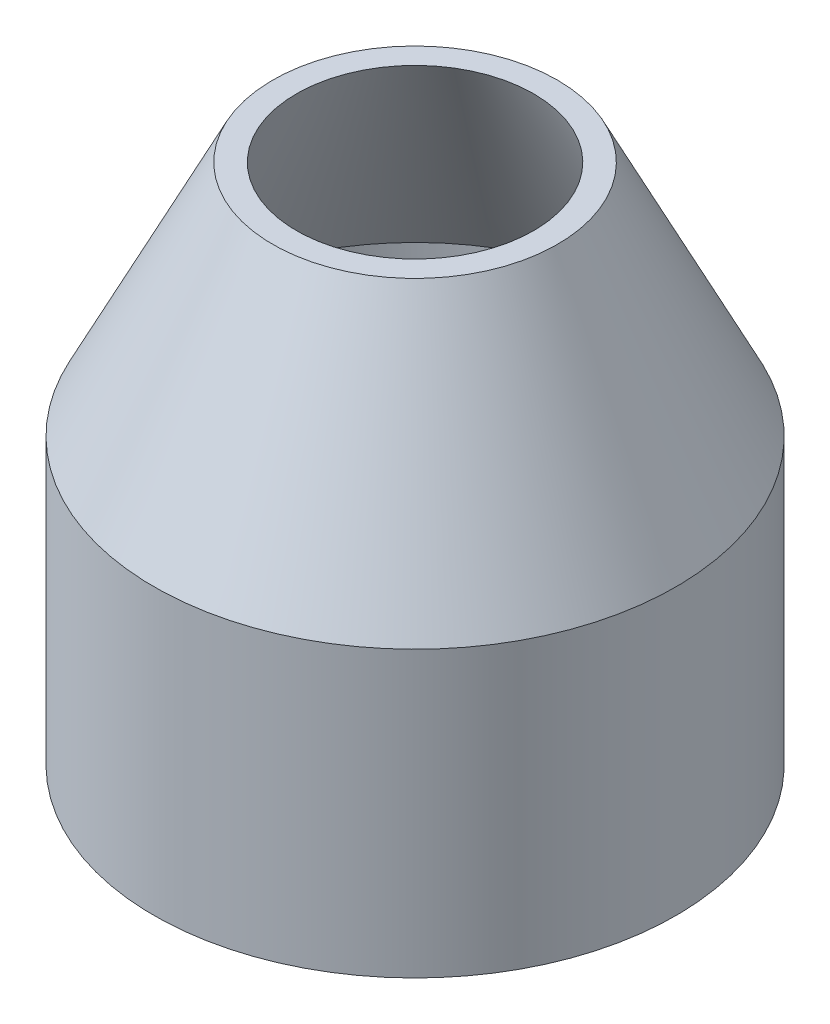
ISO-10303-21;
HEADER;
FILE_DESCRIPTION(('STEP AP214'),'2;1');
FILE_NAME('part.step','',(''),(''),'','','');
FILE_SCHEMA(('AUTOMOTIVE_DESIGN { 1 0 10303 214 1 1 1 1 }'));
ENDSEC;
DATA;
#1=APPLICATION_CONTEXT('core data for automotive mechanical design processes');
#2=APPLICATION_PROTOCOL_DEFINITION('international standard','automotive_design',2000,#1);
#3=PRODUCT_CONTEXT('',#1,'mechanical');
#4=PRODUCT('Part','Part','',(#3));
#5=PRODUCT_RELATED_PRODUCT_CATEGORY('part','',(#4));
#6=PRODUCT_DEFINITION_FORMATION('','',#4);
#7=PRODUCT_DEFINITION_CONTEXT('part definition',#1,'design');
#8=PRODUCT_DEFINITION('design','',#6,#7);
#9=PRODUCT_DEFINITION_SHAPE('','',#8);
#10=(LENGTH_UNIT() NAMED_UNIT(*) SI_UNIT(.MILLI.,.METRE.));
#11=(NAMED_UNIT(*) PLANE_ANGLE_UNIT() SI_UNIT($,.RADIAN.));
#12=(NAMED_UNIT(*) SI_UNIT($,.STERADIAN.) SOLID_ANGLE_UNIT());
#13=UNCERTAINTY_MEASURE_WITH_UNIT(LENGTH_MEASURE(1.E-05),#10,'distance_accuracy_value','');
#14=(GEOMETRIC_REPRESENTATION_CONTEXT(3) GLOBAL_UNCERTAINTY_ASSIGNED_CONTEXT((#13)) GLOBAL_UNIT_ASSIGNED_CONTEXT((#10,
#11,#12)) REPRESENTATION_CONTEXT('',''));
#15=CARTESIAN_POINT('',(0.,0.,0.));
#16=DIRECTION('',(0.,0.,1.));
#17=DIRECTION('',(1.,0.,0.));
#18=AXIS2_PLACEMENT_3D('',#15,#16,#17);
#19=CARTESIAN_POINT('',(5.,0.,0.));
#20=DIRECTION('',(0.,-1.,0.));
#21=DIRECTION('',(0.,0.,-1.));
#22=AXIS2_PLACEMENT_3D('',#19,#20,#21);
#23=PLANE('',#22);
#24=CARTESIAN_POINT('',(0.,0.,0.));
#25=DIRECTION('',(0.,-1.,0.));
#26=DIRECTION('',(0.,0.,-1.));
#27=AXIS2_PLACEMENT_3D('',#24,#25,#26);
#28=CIRCLE('',#27,5.5);
#29=CARTESIAN_POINT('',(0.,0.,-5.5));
#30=VERTEX_POINT('',#29);
#31=EDGE_CURVE('E10',#30,#30,#28,.T.);
#32=ORIENTED_EDGE('',*,*,#31,.T.);
#33=EDGE_LOOP('',(#32));
#34=FACE_BOUND('',#33,.T.);
#35=CARTESIAN_POINT('',(0.,0.,0.));
#36=DIRECTION('',(0.,-1.,0.));
#37=DIRECTION('',(0.,0.,-1.));
#38=AXIS2_PLACEMENT_3D('',#35,#36,#37);
#39=CIRCLE('',#38,5.);
#40=CARTESIAN_POINT('',(0.,0.,-5.));
#41=VERTEX_POINT('',#40);
#42=EDGE_CURVE('E64',#41,#41,#39,.T.);
#43=ORIENTED_EDGE('',*,*,#42,.F.);
#44=EDGE_LOOP('',(#43));
#45=FACE_BOUND('',#44,.T.);
#46=ADVANCED_FACE('F37',(#34,#45),#23,.T.);
#47=CARTESIAN_POINT('',(0.,0.,0.));
#48=DIRECTION('',(0.,-1.,0.));
#49=DIRECTION('',(0.,0.,-1.));
#50=AXIS2_PLACEMENT_3D('',#47,#48,#49);
#51=CYLINDRICAL_SURFACE('',#50,5.5);
#52=CARTESIAN_POINT('',(0.,5.99999999999999,0.));
#53=DIRECTION('',(0.,-1.,0.));
#54=DIRECTION('',(0.,0.,-1.));
#55=AXIS2_PLACEMENT_3D('',#52,#53,#54);
#56=CIRCLE('',#55,5.5);
#57=CARTESIAN_POINT('',(0.,5.99999999999999,-5.5));
#58=VERTEX_POINT('',#57);
#59=EDGE_CURVE('E44',#58,#58,#56,.T.);
#60=ORIENTED_EDGE('',*,*,#59,.T.);
#61=EDGE_LOOP('',(#60));
#62=FACE_BOUND('',#61,.T.);
#63=ORIENTED_EDGE('',*,*,#31,.F.);
#64=EDGE_LOOP('',(#63));
#65=FACE_BOUND('',#64,.T.);
#66=ADVANCED_FACE('F73',(#62,#65),#51,.T.);
#67=CARTESIAN_POINT('',(0.,5.99999999999999,0.));
#68=DIRECTION('',(0.,-1.,0.));
#69=DIRECTION('',(0.,0.,-1.));
#70=AXIS2_PLACEMENT_3D('',#67,#68,#69);
#71=CONICAL_SURFACE('',#70,5.5,0.463647609000807);
#72=CARTESIAN_POINT('',(0.,11.,0.));
#73=DIRECTION('',(0.,-1.,0.));
#74=DIRECTION('',(0.,0.,-1.));
#75=AXIS2_PLACEMENT_3D('',#72,#73,#74);
#76=CIRCLE('',#75,2.99999999999999);
#77=CARTESIAN_POINT('',(0.,11.,-2.99999999999999));
#78=VERTEX_POINT('',#77);
#79=EDGE_CURVE('E49',#78,#78,#76,.T.);
#80=ORIENTED_EDGE('',*,*,#79,.T.);
#81=EDGE_LOOP('',(#80));
#82=FACE_BOUND('',#81,.T.);
#83=ORIENTED_EDGE('',*,*,#59,.F.);
#84=EDGE_LOOP('',(#83));
#85=FACE_BOUND('',#84,.T.);
#86=ADVANCED_FACE('F77',(#82,#85),#71,.T.);
#87=CARTESIAN_POINT('',(2.99999999999999,11.,0.));
#88=DIRECTION('',(0.,1.,0.));
#89=DIRECTION('',(0.,0.,1.));
#90=AXIS2_PLACEMENT_3D('',#87,#88,#89);
#91=PLANE('',#90);
#92=CARTESIAN_POINT('',(0.,11.,0.));
#93=DIRECTION('',(0.,-1.,0.));
#94=DIRECTION('',(0.,0.,-1.));
#95=AXIS2_PLACEMENT_3D('',#92,#93,#94);
#96=CIRCLE('',#95,2.5);
#97=CARTESIAN_POINT('',(0.,11.,-2.5));
#98=VERTEX_POINT('',#97);
#99=EDGE_CURVE('E54',#98,#98,#96,.T.);
#100=ORIENTED_EDGE('',*,*,#99,.T.);
#101=EDGE_LOOP('',(#100));
#102=FACE_BOUND('',#101,.T.);
#103=ORIENTED_EDGE('',*,*,#79,.F.);
#104=EDGE_LOOP('',(#103));
#105=FACE_BOUND('',#104,.T.);
#106=ADVANCED_FACE('F81',(#102,#105),#91,.T.);
#107=CARTESIAN_POINT('',(0.,11.,0.));
#108=DIRECTION('',(0.,-1.,0.));
#109=DIRECTION('',(0.,0.,-1.));
#110=AXIS2_PLACEMENT_3D('',#107,#108,#109);
#111=CONICAL_SURFACE('',#110,2.5,0.463647609000806);
#112=CARTESIAN_POINT('',(0.,5.99999999999999,0.));
#113=DIRECTION('',(0.,-1.,0.));
#114=DIRECTION('',(0.,0.,-1.));
#115=AXIS2_PLACEMENT_3D('',#112,#113,#114);
#116=CIRCLE('',#115,5.);
#117=CARTESIAN_POINT('',(0.,5.99999999999999,-5.));
#118=VERTEX_POINT('',#117);
#119=EDGE_CURVE('E60',#118,#118,#116,.T.);
#120=ORIENTED_EDGE('',*,*,#119,.T.);
#121=EDGE_LOOP('',(#120));
#122=FACE_BOUND('',#121,.T.);
#123=ORIENTED_EDGE('',*,*,#99,.F.);
#124=EDGE_LOOP('',(#123));
#125=FACE_BOUND('',#124,.T.);
#126=ADVANCED_FACE('F88',(#122,#125),#111,.F.);
#127=CARTESIAN_POINT('',(0.,0.,0.));
#128=DIRECTION('',(0.,-1.,0.));
#129=DIRECTION('',(0.,0.,-1.));
#130=AXIS2_PLACEMENT_3D('',#127,#128,#129);
#131=CYLINDRICAL_SURFACE('',#130,5.);
#132=ORIENTED_EDGE('',*,*,#42,.T.);
#133=EDGE_LOOP('',(#132));
#134=FACE_BOUND('',#133,.T.);
#135=ORIENTED_EDGE('',*,*,#119,.F.);
#136=EDGE_LOOP('',(#135));
#137=FACE_BOUND('',#136,.T.);
#138=ADVANCED_FACE('F69',(#134,#137),#131,.F.);
#139=CLOSED_SHELL('',(#46,#66,#86,#106,#126,#138));
#140=MANIFOLD_SOLID_BREP('B2',#139);
#141=ADVANCED_BREP_SHAPE_REPRESENTATION('',(#18,#140),#14);
#142=SHAPE_DEFINITION_REPRESENTATION(#9,#141);
ENDSEC;
END-ISO-10303-21;
